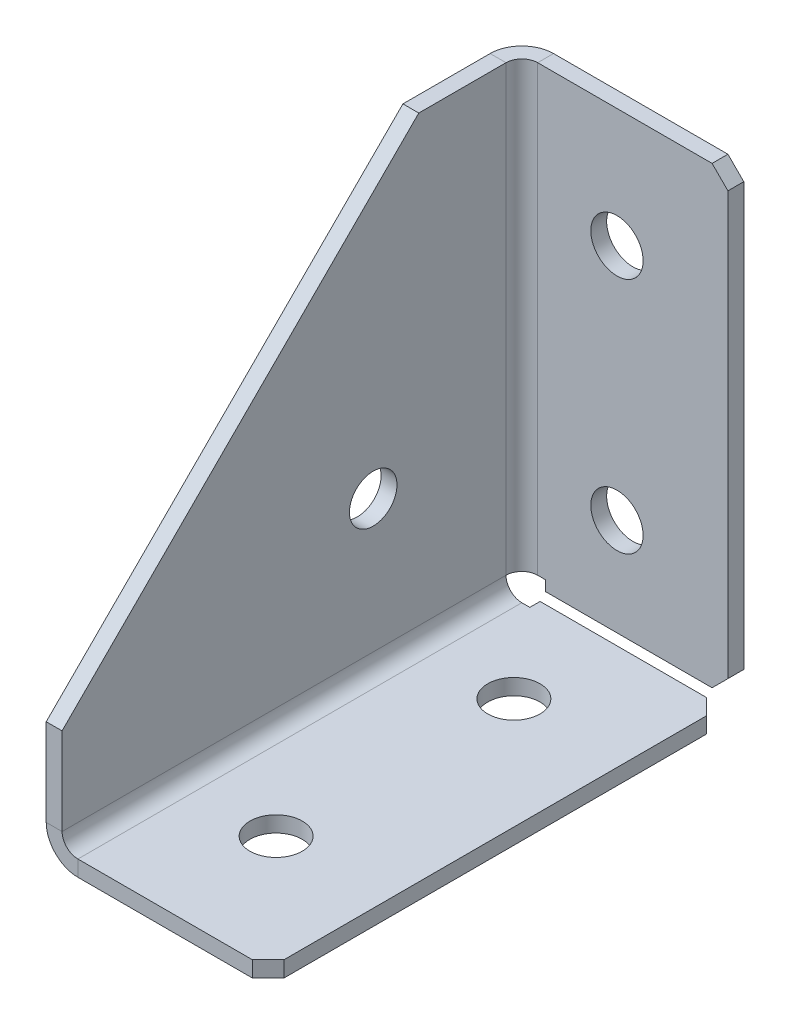
ISO-10303-21;
HEADER;
FILE_DESCRIPTION(('STEP AP214'),'2;1');
FILE_NAME('part.step','',(''),(''),'','','');
FILE_SCHEMA(('AUTOMOTIVE_DESIGN { 1 0 10303 214 1 1 1 1 }'));
ENDSEC;
DATA;
#1=APPLICATION_CONTEXT('core data for automotive mechanical design processes');
#2=APPLICATION_PROTOCOL_DEFINITION('international standard','automotive_design',2000,#1);
#3=PRODUCT_CONTEXT('',#1,'mechanical');
#4=PRODUCT('Part','Part','',(#3));
#5=PRODUCT_RELATED_PRODUCT_CATEGORY('part','',(#4));
#6=PRODUCT_DEFINITION_FORMATION('','',#4);
#7=PRODUCT_DEFINITION_CONTEXT('part definition',#1,'design');
#8=PRODUCT_DEFINITION('design','',#6,#7);
#9=PRODUCT_DEFINITION_SHAPE('','',#8);
#10=(LENGTH_UNIT() NAMED_UNIT(*) SI_UNIT(.MILLI.,.METRE.));
#11=(NAMED_UNIT(*) PLANE_ANGLE_UNIT() SI_UNIT($,.RADIAN.));
#12=(NAMED_UNIT(*) SI_UNIT($,.STERADIAN.) SOLID_ANGLE_UNIT());
#13=UNCERTAINTY_MEASURE_WITH_UNIT(LENGTH_MEASURE(1.E-05),#10,'distance_accuracy_value','');
#14=(GEOMETRIC_REPRESENTATION_CONTEXT(3) GLOBAL_UNCERTAINTY_ASSIGNED_CONTEXT((#13)) GLOBAL_UNIT_ASSIGNED_CONTEXT((#10,
#11,#12)) REPRESENTATION_CONTEXT('',''));
#15=CARTESIAN_POINT('',(0.,0.,0.));
#16=DIRECTION('',(0.,0.,1.));
#17=DIRECTION('',(1.,0.,0.));
#18=AXIS2_PLACEMENT_3D('',#15,#16,#17);
#19=CARTESIAN_POINT('',(4.,4.,3.99999999999997));
#20=DIRECTION('',(0.,0.,1.));
#21=DIRECTION('',(1.,0.,0.));
#22=AXIS2_PLACEMENT_3D('',#19,#20,#21);
#23=PLANE('',#22);
#24=DIRECTION('',(-1.,0.,0.));
#25=VECTOR('',#24,1.);
#26=CARTESIAN_POINT('',(0.,3.99999999999997,3.99999999999997));
#27=LINE('',#26,#25);
#28=CARTESIAN_POINT('',(2.,3.99999999999997,3.99999999999999));
#29=VERTEX_POINT('',#28);
#30=CARTESIAN_POINT('',(0.,3.99999999999997,3.99999999999997));
#31=VERTEX_POINT('',#30);
#32=EDGE_CURVE('E397',#29,#31,#27,.T.);
#33=ORIENTED_EDGE('',*,*,#32,.F.);
#34=CARTESIAN_POINT('',(4.,4.,3.99999999999997));
#35=DIRECTION('',(0.,0.,-1.));
#36=DIRECTION('',(-1.,0.,0.));
#37=AXIS2_PLACEMENT_3D('',#34,#35,#36);
#38=CIRCLE('',#37,2.);
#39=CARTESIAN_POINT('',(4.,2.,3.99999999999997));
#40=VERTEX_POINT('',#39);
#41=EDGE_CURVE('E342',#29,#40,#38,.F.);
#42=ORIENTED_EDGE('',*,*,#41,.T.);
#43=DIRECTION('',(0.,-1.,0.));
#44=VECTOR('',#43,1.);
#45=CARTESIAN_POINT('',(4.,0.,3.99999999999997));
#46=LINE('',#45,#44);
#47=CARTESIAN_POINT('',(4.,0.,3.99999999999997));
#48=VERTEX_POINT('',#47);
#49=EDGE_CURVE('E394',#40,#48,#46,.T.);
#50=ORIENTED_EDGE('',*,*,#49,.T.);
#51=CARTESIAN_POINT('',(4.,4.,3.99999999999997));
#52=DIRECTION('',(0.,0.,-1.));
#53=DIRECTION('',(-1.,0.,0.));
#54=AXIS2_PLACEMENT_3D('',#51,#52,#53);
#55=CIRCLE('',#54,4.);
#56=EDGE_CURVE('E281',#31,#48,#55,.F.);
#57=ORIENTED_EDGE('',*,*,#56,.F.);
#58=EDGE_LOOP('',(#33,#42,#50,#57));
#59=FACE_BOUND('',#58,.T.);
#60=ADVANCED_FACE('F44',(#59),#23,.F.);
#61=CARTESIAN_POINT('',(28.,0.,3.99999999999997));
#62=DIRECTION('',(0.,0.,1.));
#63=DIRECTION('',(1.,0.,0.));
#64=AXIS2_PLACEMENT_3D('',#61,#62,#63);
#65=PLANE('',#64);
#66=ORIENTED_EDGE('',*,*,#49,.F.);
#67=DIRECTION('',(1.,0.,0.));
#68=VECTOR('',#67,1.);
#69=CARTESIAN_POINT('',(28.,2.,3.99999999999997));
#70=LINE('',#69,#68);
#71=CARTESIAN_POINT('',(5.010401,2.,3.99999999999997));
#72=VERTEX_POINT('',#71);
#73=EDGE_CURVE('E312',#40,#72,#70,.T.);
#74=ORIENTED_EDGE('',*,*,#73,.T.);
#75=DIRECTION('',(0.,-1.,0.));
#76=VECTOR('',#75,1.);
#77=CARTESIAN_POINT('',(5.010401,0.,3.99999999999997));
#78=LINE('',#77,#76);
#79=CARTESIAN_POINT('',(5.010401,0.,3.99999999999997));
#80=VERTEX_POINT('',#79);
#81=EDGE_CURVE('E391',#72,#80,#78,.T.);
#82=ORIENTED_EDGE('',*,*,#81,.T.);
#83=DIRECTION('',(1.,0.,0.));
#84=VECTOR('',#83,1.);
#85=CARTESIAN_POINT('',(28.,0.,3.99999999999997));
#86=LINE('',#85,#84);
#87=EDGE_CURVE('E245',#48,#80,#86,.T.);
#88=ORIENTED_EDGE('',*,*,#87,.F.);
#89=EDGE_LOOP('',(#66,#74,#82,#88));
#90=FACE_BOUND('',#89,.T.);
#91=ADVANCED_FACE('F514',(#90),#65,.F.);
#92=CARTESIAN_POINT('',(5.010401,0.,60.));
#93=DIRECTION('',(-1.,0.,0.));
#94=DIRECTION('',(0.,0.,1.));
#95=AXIS2_PLACEMENT_3D('',#92,#93,#94);
#96=PLANE('',#95);
#97=ORIENTED_EDGE('',*,*,#81,.F.);
#98=DIRECTION('',(0.,0.,1.));
#99=VECTOR('',#98,1.);
#100=CARTESIAN_POINT('',(5.010401,2.,60.));
#101=LINE('',#100,#99);
#102=CARTESIAN_POINT('',(5.010401,2.,2.70710678118655));
#103=VERTEX_POINT('',#102);
#104=EDGE_CURVE('E352',#103,#72,#101,.T.);
#105=ORIENTED_EDGE('',*,*,#104,.F.);
#106=DIRECTION('',(0.,-1.,0.));
#107=VECTOR('',#106,1.);
#108=CARTESIAN_POINT('',(5.010401,0.,2.70710678118655));
#109=LINE('',#108,#107);
#110=CARTESIAN_POINT('',(5.010401,0.,2.70710678118655));
#111=VERTEX_POINT('',#110);
#112=EDGE_CURVE('E388',#103,#111,#109,.T.);
#113=ORIENTED_EDGE('',*,*,#112,.T.);
#114=DIRECTION('',(0.,0.,1.));
#115=VECTOR('',#114,1.);
#116=CARTESIAN_POINT('',(5.010401,0.,60.));
#117=LINE('',#116,#115);
#118=EDGE_CURVE('E241',#111,#80,#117,.T.);
#119=ORIENTED_EDGE('',*,*,#118,.T.);
#120=EDGE_LOOP('',(#97,#105,#113,#119));
#121=FACE_BOUND('',#120,.T.);
#122=ADVANCED_FACE('F519',(#121),#96,.T.);
#123=CARTESIAN_POINT('',(28.,0.,2.70710678118655));
#124=DIRECTION('',(0.,0.,1.));
#125=DIRECTION('',(1.,0.,0.));
#126=AXIS2_PLACEMENT_3D('',#123,#124,#125);
#127=PLANE('',#126);
#128=DIRECTION('',(1.,0.,0.));
#129=VECTOR('',#128,1.);
#130=CARTESIAN_POINT('',(28.,2.,2.70710678118655));
#131=LINE('',#130,#129);
#132=CARTESIAN_POINT('',(26.,2.,2.70710678118655));
#133=VERTEX_POINT('',#132);
#134=EDGE_CURVE('E316',#103,#133,#131,.T.);
#135=ORIENTED_EDGE('',*,*,#134,.T.);
#136=DIRECTION('',(0.,1.,0.));
#137=VECTOR('',#136,1.);
#138=CARTESIAN_POINT('',(26.,0.,2.70710678118655));
#139=LINE('',#138,#137);
#140=CARTESIAN_POINT('',(26.,0.,2.70710678118655));
#141=VERTEX_POINT('',#140);
#142=EDGE_CURVE('E424',#133,#141,#139,.F.);
#143=ORIENTED_EDGE('',*,*,#142,.T.);
#144=DIRECTION('',(1.,0.,0.));
#145=VECTOR('',#144,1.);
#146=CARTESIAN_POINT('',(28.,0.,2.70710678118655));
#147=LINE('',#146,#145);
#148=EDGE_CURVE('E237',#111,#141,#147,.T.);
#149=ORIENTED_EDGE('',*,*,#148,.F.);
#150=ORIENTED_EDGE('',*,*,#112,.F.);
#151=EDGE_LOOP('',(#135,#143,#149,#150));
#152=FACE_BOUND('',#151,.T.);
#153=ADVANCED_FACE('F556',(#152),#127,.F.);
#154=CARTESIAN_POINT('',(28.,0.,60.));
#155=DIRECTION('',(1.,0.,0.));
#156=DIRECTION('',(0.,0.,-1.));
#157=AXIS2_PLACEMENT_3D('',#154,#155,#156);
#158=PLANE('',#157);
#159=DIRECTION('',(0.,0.,1.));
#160=VECTOR('',#159,1.);
#161=CARTESIAN_POINT('',(28.,2.,60.));
#162=LINE('',#161,#160);
#163=CARTESIAN_POINT('',(28.,2.,58.));
#164=VERTEX_POINT('',#163);
#165=CARTESIAN_POINT('',(28.,2.,4.70710678118655));
#166=VERTEX_POINT('',#165);
#167=EDGE_CURVE('E345',#164,#166,#162,.F.);
#168=ORIENTED_EDGE('',*,*,#167,.F.);
#169=DIRECTION('',(0.,-1.,0.));
#170=VECTOR('',#169,1.);
#171=CARTESIAN_POINT('',(28.,0.,58.));
#172=LINE('',#171,#170);
#173=CARTESIAN_POINT('',(28.,0.,58.));
#174=VERTEX_POINT('',#173);
#175=EDGE_CURVE('E405',#164,#174,#172,.T.);
#176=ORIENTED_EDGE('',*,*,#175,.T.);
#177=DIRECTION('',(0.,0.,-1.));
#178=VECTOR('',#177,1.);
#179=CARTESIAN_POINT('',(28.,0.,60.));
#180=LINE('',#179,#178);
#181=CARTESIAN_POINT('',(28.,0.,4.70710678118655));
#182=VERTEX_POINT('',#181);
#183=EDGE_CURVE('E274',#174,#182,#180,.T.);
#184=ORIENTED_EDGE('',*,*,#183,.T.);
#185=DIRECTION('',(0.,1.,0.));
#186=VECTOR('',#185,1.);
#187=CARTESIAN_POINT('',(28.,0.,4.70710678118655));
#188=LINE('',#187,#186);
#189=EDGE_CURVE('E400',#182,#166,#188,.T.);
#190=ORIENTED_EDGE('',*,*,#189,.T.);
#191=EDGE_LOOP('',(#168,#176,#184,#190));
#192=FACE_BOUND('',#191,.T.);
#193=ADVANCED_FACE('F570',(#192),#158,.T.);
#194=CARTESIAN_POINT('',(28.,0.,60.));
#195=DIRECTION('',(0.,0.,-1.));
#196=DIRECTION('',(-1.,0.,0.));
#197=AXIS2_PLACEMENT_3D('',#194,#195,#196);
#198=PLANE('',#197);
#199=DIRECTION('',(-1.,0.,0.));
#200=VECTOR('',#199,1.);
#201=CARTESIAN_POINT('',(28.,0.,60.));
#202=LINE('',#201,#200);
#203=CARTESIAN_POINT('',(26.,0.,60.));
#204=VERTEX_POINT('',#203);
#205=CARTESIAN_POINT('',(4.,0.,60.));
#206=VERTEX_POINT('',#205);
#207=EDGE_CURVE('E216',#204,#206,#202,.T.);
#208=ORIENTED_EDGE('',*,*,#207,.F.);
#209=DIRECTION('',(0.,-1.,0.));
#210=VECTOR('',#209,1.);
#211=CARTESIAN_POINT('',(26.,0.,60.));
#212=LINE('',#211,#210);
#213=CARTESIAN_POINT('',(26.,2.,60.));
#214=VERTEX_POINT('',#213);
#215=EDGE_CURVE('E415',#204,#214,#212,.F.);
#216=ORIENTED_EDGE('',*,*,#215,.T.);
#217=DIRECTION('',(1.,0.,0.));
#218=VECTOR('',#217,1.);
#219=CARTESIAN_POINT('',(28.,2.,60.));
#220=LINE('',#219,#218);
#221=CARTESIAN_POINT('',(4.,2.,60.));
#222=VERTEX_POINT('',#221);
#223=EDGE_CURVE('E338',#214,#222,#220,.F.);
#224=ORIENTED_EDGE('',*,*,#223,.T.);
#225=DIRECTION('',(0.,-1.,0.));
#226=VECTOR('',#225,1.);
#227=CARTESIAN_POINT('',(4.,0.,60.));
#228=LINE('',#227,#226);
#229=EDGE_CURVE('E384',#222,#206,#228,.T.);
#230=ORIENTED_EDGE('',*,*,#229,.T.);
#231=EDGE_LOOP('',(#208,#216,#224,#230));
#232=FACE_BOUND('',#231,.T.);
#233=ADVANCED_FACE('F664',(#232),#198,.F.);
#234=CARTESIAN_POINT('',(4.,4.,60.));
#235=DIRECTION('',(0.,0.,1.));
#236=DIRECTION('',(1.,0.,0.));
#237=AXIS2_PLACEMENT_3D('',#234,#235,#236);
#238=PLANE('',#237);
#239=ORIENTED_EDGE('',*,*,#229,.F.);
#240=CARTESIAN_POINT('',(4.,4.,60.));
#241=DIRECTION('',(0.,0.,-1.));
#242=DIRECTION('',(-1.,0.,0.));
#243=AXIS2_PLACEMENT_3D('',#240,#241,#242);
#244=CIRCLE('',#243,2.);
#245=CARTESIAN_POINT('',(2.,4.,60.));
#246=VERTEX_POINT('',#245);
#247=EDGE_CURVE('E329',#222,#246,#244,.T.);
#248=ORIENTED_EDGE('',*,*,#247,.T.);
#249=DIRECTION('',(-1.,0.,0.));
#250=VECTOR('',#249,1.);
#251=CARTESIAN_POINT('',(0.,4.,60.));
#252=LINE('',#251,#250);
#253=CARTESIAN_POINT('',(0.,4.,60.));
#254=VERTEX_POINT('',#253);
#255=EDGE_CURVE('E203',#246,#254,#252,.T.);
#256=ORIENTED_EDGE('',*,*,#255,.T.);
#257=CARTESIAN_POINT('',(4.,4.,60.));
#258=DIRECTION('',(0.,0.,-1.));
#259=DIRECTION('',(-1.,0.,0.));
#260=AXIS2_PLACEMENT_3D('',#257,#258,#259);
#261=CIRCLE('',#260,4.);
#262=EDGE_CURVE('E270',#206,#254,#261,.T.);
#263=ORIENTED_EDGE('',*,*,#262,.F.);
#264=EDGE_LOOP('',(#239,#248,#256,#263));
#265=FACE_BOUND('',#264,.T.);
#266=ADVANCED_FACE('F487',(#265),#238,.T.);
#267=CARTESIAN_POINT('',(0.,15.,60.));
#268=DIRECTION('',(0.,0.,1.));
#269=DIRECTION('',(0.,-1.,0.));
#270=AXIS2_PLACEMENT_3D('',#267,#268,#269);
#271=PLANE('',#270);
#272=ORIENTED_EDGE('',*,*,#255,.F.);
#273=DIRECTION('',(0.,1.,0.));
#274=VECTOR('',#273,1.);
#275=CARTESIAN_POINT('',(2.,0.,60.));
#276=LINE('',#275,#274);
#277=CARTESIAN_POINT('',(2.,15.,60.));
#278=VERTEX_POINT('',#277);
#279=EDGE_CURVE('E197',#278,#246,#276,.F.);
#280=ORIENTED_EDGE('',*,*,#279,.F.);
#281=DIRECTION('',(-1.,0.,0.));
#282=VECTOR('',#281,1.);
#283=CARTESIAN_POINT('',(0.,15.,60.));
#284=LINE('',#283,#282);
#285=CARTESIAN_POINT('',(0.,15.,60.));
#286=VERTEX_POINT('',#285);
#287=EDGE_CURVE('E191',#278,#286,#284,.T.);
#288=ORIENTED_EDGE('',*,*,#287,.T.);
#289=DIRECTION('',(0.,-1.,0.));
#290=VECTOR('',#289,1.);
#291=CARTESIAN_POINT('',(0.,15.,60.));
#292=LINE('',#291,#290);
#293=EDGE_CURVE('E194',#286,#254,#292,.T.);
#294=ORIENTED_EDGE('',*,*,#293,.T.);
#295=EDGE_LOOP('',(#272,#280,#288,#294));
#296=FACE_BOUND('',#295,.T.);
#297=ADVANCED_FACE('F193',(#296),#271,.T.);
#298=CARTESIAN_POINT('',(0.,60.,15.));
#299=DIRECTION('',(0.,0.707106781186548,0.707106781186548));
#300=DIRECTION('',(0.,-0.707106781186548,0.707106781186548));
#301=AXIS2_PLACEMENT_3D('',#298,#299,#300);
#302=PLANE('',#301);
#303=ORIENTED_EDGE('',*,*,#287,.F.);
#304=DIRECTION('',(0.,-0.707106781186548,0.707106781186548));
#305=VECTOR('',#304,1.);
#306=CARTESIAN_POINT('',(2.,60.,15.));
#307=LINE('',#306,#305);
#308=CARTESIAN_POINT('',(2.,60.,15.));
#309=VERTEX_POINT('',#308);
#310=EDGE_CURVE('E333',#309,#278,#307,.T.);
#311=ORIENTED_EDGE('',*,*,#310,.F.);
#312=DIRECTION('',(-1.,0.,0.));
#313=VECTOR('',#312,1.);
#314=CARTESIAN_POINT('',(0.,60.,15.));
#315=LINE('',#314,#313);
#316=CARTESIAN_POINT('',(0.,60.,15.));
#317=VERTEX_POINT('',#316);
#318=EDGE_CURVE('E204',#309,#317,#315,.T.);
#319=ORIENTED_EDGE('',*,*,#318,.T.);
#320=DIRECTION('',(0.,-0.707106781186548,0.707106781186548));
#321=VECTOR('',#320,1.);
#322=CARTESIAN_POINT('',(0.,60.,15.));
#323=LINE('',#322,#321);
#324=EDGE_CURVE('E211',#317,#286,#323,.T.);
#325=ORIENTED_EDGE('',*,*,#324,.T.);
#326=EDGE_LOOP('',(#303,#311,#319,#325));
#327=FACE_BOUND('',#326,.T.);
#328=ADVANCED_FACE('F218',(#327),#302,.T.);
#329=CARTESIAN_POINT('',(0.,60.,0.));
#330=DIRECTION('',(0.,1.,0.));
#331=DIRECTION('',(0.,0.,1.));
#332=AXIS2_PLACEMENT_3D('',#329,#330,#331);
#333=PLANE('',#332);
#334=ORIENTED_EDGE('',*,*,#318,.F.);
#335=DIRECTION('',(0.,0.,-1.));
#336=VECTOR('',#335,1.);
#337=CARTESIAN_POINT('',(2.,60.,0.));
#338=LINE('',#337,#336);
#339=CARTESIAN_POINT('',(2.,60.,4.));
#340=VERTEX_POINT('',#339);
#341=EDGE_CURVE('E323',#340,#309,#338,.F.);
#342=ORIENTED_EDGE('',*,*,#341,.F.);
#343=DIRECTION('',(-1.,0.,0.));
#344=VECTOR('',#343,1.);
#345=CARTESIAN_POINT('',(0.,60.,4.));
#346=LINE('',#345,#344);
#347=CARTESIAN_POINT('',(0.,60.,4.));
#348=VERTEX_POINT('',#347);
#349=EDGE_CURVE('E377',#340,#348,#346,.T.);
#350=ORIENTED_EDGE('',*,*,#349,.T.);
#351=DIRECTION('',(0.,0.,1.));
#352=VECTOR('',#351,1.);
#353=CARTESIAN_POINT('',(0.,60.,0.));
#354=LINE('',#353,#352);
#355=EDGE_CURVE('E220',#348,#317,#354,.T.);
#356=ORIENTED_EDGE('',*,*,#355,.T.);
#357=EDGE_LOOP('',(#334,#342,#350,#356));
#358=FACE_BOUND('',#357,.T.);
#359=ADVANCED_FACE('F499',(#358),#333,.T.);
#360=CARTESIAN_POINT('',(4.,60.,4.));
#361=DIRECTION('',(0.,-1.,0.));
#362=DIRECTION('',(0.,0.,-1.));
#363=AXIS2_PLACEMENT_3D('',#360,#361,#362);
#364=PLANE('',#363);
#365=ORIENTED_EDGE('',*,*,#349,.F.);
#366=CARTESIAN_POINT('',(4.,60.,4.));
#367=DIRECTION('',(0.,1.,0.));
#368=DIRECTION('',(0.,0.,1.));
#369=AXIS2_PLACEMENT_3D('',#366,#367,#368);
#370=CIRCLE('',#369,2.);
#371=CARTESIAN_POINT('',(4.,60.,2.));
#372=VERTEX_POINT('',#371);
#373=EDGE_CURVE('E324',#340,#372,#370,.F.);
#374=ORIENTED_EDGE('',*,*,#373,.T.);
#375=DIRECTION('',(0.,0.,-1.));
#376=VECTOR('',#375,1.);
#377=CARTESIAN_POINT('',(4.,60.,0.));
#378=LINE('',#377,#376);
#379=CARTESIAN_POINT('',(4.,60.,0.));
#380=VERTEX_POINT('',#379);
#381=EDGE_CURVE('E373',#372,#380,#378,.T.);
#382=ORIENTED_EDGE('',*,*,#381,.T.);
#383=CARTESIAN_POINT('',(4.,60.,4.));
#384=DIRECTION('',(0.,1.,0.));
#385=DIRECTION('',(0.,0.,1.));
#386=AXIS2_PLACEMENT_3D('',#383,#384,#385);
#387=CIRCLE('',#386,4.);
#388=EDGE_CURVE('E265',#348,#380,#387,.F.);
#389=ORIENTED_EDGE('',*,*,#388,.F.);
#390=EDGE_LOOP('',(#365,#374,#382,#389));
#391=FACE_BOUND('',#390,.T.);
#392=ADVANCED_FACE('F501',(#391),#364,.F.);
#393=CARTESIAN_POINT('',(28.,60.,0.));
#394=DIRECTION('',(0.,1.,0.));
#395=DIRECTION('',(-1.,0.,0.));
#396=AXIS2_PLACEMENT_3D('',#393,#394,#395);
#397=PLANE('',#396);
#398=DIRECTION('',(1.,0.,0.));
#399=VECTOR('',#398,1.);
#400=CARTESIAN_POINT('',(28.,60.,2.));
#401=LINE('',#400,#399);
#402=CARTESIAN_POINT('',(26.,60.,2.));
#403=VERTEX_POINT('',#402);
#404=EDGE_CURVE('E320',#403,#372,#401,.F.);
#405=ORIENTED_EDGE('',*,*,#404,.F.);
#406=DIRECTION('',(0.,0.,-1.));
#407=VECTOR('',#406,1.);
#408=CARTESIAN_POINT('',(26.,60.,0.));
#409=LINE('',#408,#407);
#410=CARTESIAN_POINT('',(26.,60.,0.));
#411=VERTEX_POINT('',#410);
#412=EDGE_CURVE('E11',#403,#411,#409,.T.);
#413=ORIENTED_EDGE('',*,*,#412,.T.);
#414=DIRECTION('',(-1.,0.,0.));
#415=VECTOR('',#414,1.);
#416=CARTESIAN_POINT('',(28.,60.,0.));
#417=LINE('',#416,#415);
#418=EDGE_CURVE('E224',#411,#380,#417,.T.);
#419=ORIENTED_EDGE('',*,*,#418,.T.);
#420=ORIENTED_EDGE('',*,*,#381,.F.);
#421=EDGE_LOOP('',(#405,#413,#419,#420));
#422=FACE_BOUND('',#421,.T.);
#423=ADVANCED_FACE('F505',(#422),#397,.T.);
#424=CARTESIAN_POINT('',(28.,0.,0.));
#425=DIRECTION('',(1.,0.,0.));
#426=DIRECTION('',(0.,1.,0.));
#427=AXIS2_PLACEMENT_3D('',#424,#425,#426);
#428=PLANE('',#427);
#429=DIRECTION('',(0.,1.,0.));
#430=VECTOR('',#429,1.);
#431=CARTESIAN_POINT('',(28.,0.,2.));
#432=LINE('',#431,#430);
#433=CARTESIAN_POINT('',(28.,4.70710678118655,2.));
#434=VERTEX_POINT('',#433);
#435=CARTESIAN_POINT('',(28.,58.,2.));
#436=VERTEX_POINT('',#435);
#437=EDGE_CURVE('E317',#434,#436,#432,.T.);
#438=ORIENTED_EDGE('',*,*,#437,.F.);
#439=DIRECTION('',(0.,0.,-1.));
#440=VECTOR('',#439,1.);
#441=CARTESIAN_POINT('',(28.,4.70710678118655,0.));
#442=LINE('',#441,#440);
#443=CARTESIAN_POINT('',(28.,4.70710678118655,0.));
#444=VERTEX_POINT('',#443);
#445=EDGE_CURVE('E431',#434,#444,#442,.T.);
#446=ORIENTED_EDGE('',*,*,#445,.T.);
#447=DIRECTION('',(0.,1.,0.));
#448=VECTOR('',#447,1.);
#449=CARTESIAN_POINT('',(28.,0.,0.));
#450=LINE('',#449,#448);
#451=CARTESIAN_POINT('',(28.,58.,0.));
#452=VERTEX_POINT('',#451);
#453=EDGE_CURVE('E230',#444,#452,#450,.T.);
#454=ORIENTED_EDGE('',*,*,#453,.T.);
#455=DIRECTION('',(0.,0.,1.));
#456=VECTOR('',#455,1.);
#457=CARTESIAN_POINT('',(28.,58.,0.));
#458=LINE('',#457,#456);
#459=EDGE_CURVE('E428',#452,#436,#458,.T.);
#460=ORIENTED_EDGE('',*,*,#459,.T.);
#461=EDGE_LOOP('',(#438,#446,#454,#460));
#462=FACE_BOUND('',#461,.T.);
#463=ADVANCED_FACE('F452',(#462),#428,.T.);
#464=CARTESIAN_POINT('',(28.,2.70710678118655,0.));
#465=DIRECTION('',(0.,1.,0.));
#466=DIRECTION('',(-1.,0.,0.));
#467=AXIS2_PLACEMENT_3D('',#464,#465,#466);
#468=PLANE('',#467);
#469=DIRECTION('',(-1.,0.,0.));
#470=VECTOR('',#469,1.);
#471=CARTESIAN_POINT('',(28.,2.70710678118655,0.));
#472=LINE('',#471,#470);
#473=CARTESIAN_POINT('',(26.,2.70710678118655,0.));
#474=VERTEX_POINT('',#473);
#475=CARTESIAN_POINT('',(5.010401,2.70710678118655,0.));
#476=VERTEX_POINT('',#475);
#477=EDGE_CURVE('E234',#474,#476,#472,.T.);
#478=ORIENTED_EDGE('',*,*,#477,.F.);
#479=DIRECTION('',(0.,0.,-1.));
#480=VECTOR('',#479,1.);
#481=CARTESIAN_POINT('',(26.,2.70710678118655,0.));
#482=LINE('',#481,#480);
#483=CARTESIAN_POINT('',(26.,2.70710678118655,2.));
#484=VERTEX_POINT('',#483);
#485=EDGE_CURVE('E69',#474,#484,#482,.F.);
#486=ORIENTED_EDGE('',*,*,#485,.T.);
#487=DIRECTION('',(1.,0.,0.));
#488=VECTOR('',#487,1.);
#489=CARTESIAN_POINT('',(28.,2.70710678118655,2.));
#490=LINE('',#489,#488);
#491=CARTESIAN_POINT('',(5.010401,2.70710678118655,2.));
#492=VERTEX_POINT('',#491);
#493=EDGE_CURVE('E313',#484,#492,#490,.F.);
#494=ORIENTED_EDGE('',*,*,#493,.T.);
#495=DIRECTION('',(0.,0.,-1.));
#496=VECTOR('',#495,1.);
#497=CARTESIAN_POINT('',(5.010401,2.70710678118655,0.));
#498=LINE('',#497,#496);
#499=EDGE_CURVE('E369',#492,#476,#498,.T.);
#500=ORIENTED_EDGE('',*,*,#499,.T.);
#501=EDGE_LOOP('',(#478,#486,#494,#500));
#502=FACE_BOUND('',#501,.T.);
#503=ADVANCED_FACE('F459',(#502),#468,.F.);
#504=CARTESIAN_POINT('',(5.010401,0.,0.));
#505=DIRECTION('',(-1.,0.,0.));
#506=DIRECTION('',(0.,-1.,0.));
#507=AXIS2_PLACEMENT_3D('',#504,#505,#506);
#508=PLANE('',#507);
#509=ORIENTED_EDGE('',*,*,#499,.F.);
#510=DIRECTION('',(0.,1.,0.));
#511=VECTOR('',#510,1.);
#512=CARTESIAN_POINT('',(5.010401,0.,2.));
#513=LINE('',#512,#511);
#514=CARTESIAN_POINT('',(5.010401,3.99999999999997,2.));
#515=VERTEX_POINT('',#514);
#516=EDGE_CURVE('E308',#515,#492,#513,.F.);
#517=ORIENTED_EDGE('',*,*,#516,.F.);
#518=DIRECTION('',(0.,0.,-1.));
#519=VECTOR('',#518,1.);
#520=CARTESIAN_POINT('',(5.010401,3.99999999999997,0.));
#521=LINE('',#520,#519);
#522=CARTESIAN_POINT('',(5.010401,3.99999999999997,0.));
#523=VERTEX_POINT('',#522);
#524=EDGE_CURVE('E366',#515,#523,#521,.T.);
#525=ORIENTED_EDGE('',*,*,#524,.T.);
#526=DIRECTION('',(0.,-1.,0.));
#527=VECTOR('',#526,1.);
#528=CARTESIAN_POINT('',(5.010401,0.,0.));
#529=LINE('',#528,#527);
#530=EDGE_CURVE('E249',#523,#476,#529,.T.);
#531=ORIENTED_EDGE('',*,*,#530,.T.);
#532=EDGE_LOOP('',(#509,#517,#525,#531));
#533=FACE_BOUND('',#532,.T.);
#534=ADVANCED_FACE('F463',(#533),#508,.T.);
#535=CARTESIAN_POINT('',(28.,3.99999999999997,0.));
#536=DIRECTION('',(0.,1.,0.));
#537=DIRECTION('',(-1.,0.,0.));
#538=AXIS2_PLACEMENT_3D('',#535,#536,#537);
#539=PLANE('',#538);
#540=ORIENTED_EDGE('',*,*,#524,.F.);
#541=DIRECTION('',(1.,0.,0.));
#542=VECTOR('',#541,1.);
#543=CARTESIAN_POINT('',(28.,3.99999999999997,2.));
#544=LINE('',#543,#542);
#545=CARTESIAN_POINT('',(4.,3.99999999999997,2.));
#546=VERTEX_POINT('',#545);
#547=EDGE_CURVE('E294',#515,#546,#544,.F.);
#548=ORIENTED_EDGE('',*,*,#547,.T.);
#549=DIRECTION('',(0.,0.,-1.));
#550=VECTOR('',#549,1.);
#551=CARTESIAN_POINT('',(4.,3.99999999999997,0.));
#552=LINE('',#551,#550);
#553=CARTESIAN_POINT('',(4.,3.99999999999997,0.));
#554=VERTEX_POINT('',#553);
#555=EDGE_CURVE('E280',#546,#554,#552,.T.);
#556=ORIENTED_EDGE('',*,*,#555,.T.);
#557=DIRECTION('',(-1.,0.,0.));
#558=VECTOR('',#557,1.);
#559=CARTESIAN_POINT('',(28.,3.99999999999997,0.));
#560=LINE('',#559,#558);
#561=EDGE_CURVE('E253',#523,#554,#560,.T.);
#562=ORIENTED_EDGE('',*,*,#561,.F.);
#563=EDGE_LOOP('',(#540,#548,#556,#562));
#564=FACE_BOUND('',#563,.T.);
#565=ADVANCED_FACE('F467',(#564),#539,.F.);
#566=CARTESIAN_POINT('',(4.,3.99999999999997,4.));
#567=DIRECTION('',(0.,1.,0.));
#568=DIRECTION('',(0.,0.,1.));
#569=AXIS2_PLACEMENT_3D('',#566,#567,#568);
#570=PLANE('',#569);
#571=CARTESIAN_POINT('',(4.,3.99999999999997,4.));
#572=DIRECTION('',(0.,1.,0.));
#573=DIRECTION('',(0.,0.,1.));
#574=AXIS2_PLACEMENT_3D('',#571,#572,#573);
#575=CIRCLE('',#574,2.);
#576=EDGE_CURVE('E328',#546,#29,#575,.T.);
#577=ORIENTED_EDGE('',*,*,#576,.T.);
#578=ORIENTED_EDGE('',*,*,#32,.T.);
#579=CARTESIAN_POINT('',(4.,3.99999999999997,4.));
#580=DIRECTION('',(0.,-1.,0.));
#581=DIRECTION('',(0.,0.,-1.));
#582=AXIS2_PLACEMENT_3D('',#579,#580,#581);
#583=CIRCLE('',#582,4.);
#584=EDGE_CURVE('E269',#554,#31,#583,.F.);
#585=ORIENTED_EDGE('',*,*,#584,.F.);
#586=ORIENTED_EDGE('',*,*,#555,.F.);
#587=EDGE_LOOP('',(#577,#578,#585,#586));
#588=FACE_BOUND('',#587,.T.);
#589=ADVANCED_FACE('F472',(#588),#570,.F.);
#590=CARTESIAN_POINT('',(28.,0.,0.));
#591=DIRECTION('',(0.,0.,1.));
#592=DIRECTION('',(1.,0.,0.));
#593=AXIS2_PLACEMENT_3D('',#590,#591,#592);
#594=PLANE('',#593);
#595=CARTESIAN_POINT('',(14.,45.,0.));
#596=DIRECTION('',(0.,0.,1.));
#597=DIRECTION('',(1.,0.,0.));
#598=AXIS2_PLACEMENT_3D('',#595,#596,#597);
#599=CIRCLE('',#598,3.3);
#600=CARTESIAN_POINT('',(17.3,45.,0.));
#601=VERTEX_POINT('',#600);
#602=EDGE_CURVE('E584',#601,#601,#599,.T.);
#603=ORIENTED_EDGE('',*,*,#602,.T.);
#604=EDGE_LOOP('',(#603));
#605=FACE_BOUND('',#604,.T.);
#606=CARTESIAN_POINT('',(14.,15.,0.));
#607=DIRECTION('',(0.,0.,1.));
#608=DIRECTION('',(1.,0.,0.));
#609=AXIS2_PLACEMENT_3D('',#606,#607,#608);
#610=CIRCLE('',#609,3.3);
#611=CARTESIAN_POINT('',(17.3,15.,0.));
#612=VERTEX_POINT('',#611);
#613=EDGE_CURVE('E362',#612,#612,#610,.T.);
#614=ORIENTED_EDGE('',*,*,#613,.T.);
#615=EDGE_LOOP('',(#614));
#616=FACE_BOUND('',#615,.T.);
#617=ORIENTED_EDGE('',*,*,#453,.F.);
#618=DIRECTION('',(-0.707106781186548,-0.707106781186548,0.));
#619=VECTOR('',#618,1.);
#620=CARTESIAN_POINT('',(28.,4.70710678118655,0.));
#621=LINE('',#620,#619);
#622=EDGE_CURVE('E438',#444,#474,#621,.T.);
#623=ORIENTED_EDGE('',*,*,#622,.T.);
#624=ORIENTED_EDGE('',*,*,#477,.T.);
#625=ORIENTED_EDGE('',*,*,#530,.F.);
#626=ORIENTED_EDGE('',*,*,#561,.T.);
#627=DIRECTION('',(0.,1.,0.));
#628=VECTOR('',#627,1.);
#629=CARTESIAN_POINT('',(4.,0.,0.));
#630=LINE('',#629,#628);
#631=EDGE_CURVE('E257',#554,#380,#630,.T.);
#632=ORIENTED_EDGE('',*,*,#631,.T.);
#633=ORIENTED_EDGE('',*,*,#418,.F.);
#634=DIRECTION('',(-0.707106781186548,0.707106781186548,0.));
#635=VECTOR('',#634,1.);
#636=CARTESIAN_POINT('',(26.,60.,0.));
#637=LINE('',#636,#635);
#638=EDGE_CURVE('E435',#411,#452,#637,.F.);
#639=ORIENTED_EDGE('',*,*,#638,.T.);
#640=EDGE_LOOP('',(#617,#623,#624,#625,#626,#632,#633,#639));
#641=FACE_BOUND('',#640,.T.);
#642=ADVANCED_FACE('F457',(#605,#616,#641),#594,.F.);
#643=CARTESIAN_POINT('',(0.,0.,0.));
#644=DIRECTION('',(1.,0.,0.));
#645=DIRECTION('',(0.,0.,-1.));
#646=AXIS2_PLACEMENT_3D('',#643,#644,#645);
#647=PLANE('',#646);
#648=CARTESIAN_POINT('',(0.,20.75,20.75));
#649=DIRECTION('',(1.,0.,0.));
#650=DIRECTION('',(0.,0.,-1.));
#651=AXIS2_PLACEMENT_3D('',#648,#649,#650);
#652=CIRCLE('',#651,3.);
#653=CARTESIAN_POINT('',(0.,20.75,17.75));
#654=VERTEX_POINT('',#653);
#655=EDGE_CURVE('E608',#654,#654,#652,.T.);
#656=ORIENTED_EDGE('',*,*,#655,.T.);
#657=EDGE_LOOP('',(#656));
#658=FACE_BOUND('',#657,.T.);
#659=DIRECTION('',(0.,1.,0.));
#660=VECTOR('',#659,1.);
#661=CARTESIAN_POINT('',(0.,0.,4.));
#662=LINE('',#661,#660);
#663=EDGE_CURVE('E261',#348,#31,#662,.F.);
#664=ORIENTED_EDGE('',*,*,#663,.T.);
#665=DIRECTION('',(0.,0.,-1.));
#666=VECTOR('',#665,1.);
#667=CARTESIAN_POINT('',(0.,4.,0.));
#668=LINE('',#667,#666);
#669=EDGE_CURVE('E214',#31,#254,#668,.F.);
#670=ORIENTED_EDGE('',*,*,#669,.T.);
#671=ORIENTED_EDGE('',*,*,#293,.F.);
#672=ORIENTED_EDGE('',*,*,#324,.F.);
#673=ORIENTED_EDGE('',*,*,#355,.F.);
#674=EDGE_LOOP('',(#664,#670,#671,#672,#673));
#675=FACE_BOUND('',#674,.T.);
#676=ADVANCED_FACE('F209',(#658,#675),#647,.F.);
#677=CARTESIAN_POINT('',(28.,0.,60.));
#678=DIRECTION('',(0.,1.,0.));
#679=DIRECTION('',(0.,0.,1.));
#680=AXIS2_PLACEMENT_3D('',#677,#678,#679);
#681=PLANE('',#680);
#682=CARTESIAN_POINT('',(14.,0.,45.));
#683=DIRECTION('',(0.,1.,0.));
#684=DIRECTION('',(0.,0.,1.));
#685=AXIS2_PLACEMENT_3D('',#682,#683,#684);
#686=CIRCLE('',#685,3.3);
#687=CARTESIAN_POINT('',(14.,0.,48.3));
#688=VERTEX_POINT('',#687);
#689=EDGE_CURVE('E600',#688,#688,#686,.T.);
#690=ORIENTED_EDGE('',*,*,#689,.T.);
#691=EDGE_LOOP('',(#690));
#692=FACE_BOUND('',#691,.T.);
#693=CARTESIAN_POINT('',(14.,0.,15.));
#694=DIRECTION('',(0.,1.,0.));
#695=DIRECTION('',(0.,0.,1.));
#696=AXIS2_PLACEMENT_3D('',#693,#694,#695);
#697=CIRCLE('',#696,3.3);
#698=CARTESIAN_POINT('',(14.,0.,18.3));
#699=VERTEX_POINT('',#698);
#700=EDGE_CURVE('E592',#699,#699,#697,.T.);
#701=ORIENTED_EDGE('',*,*,#700,.T.);
#702=EDGE_LOOP('',(#701));
#703=FACE_BOUND('',#702,.T.);
#704=ORIENTED_EDGE('',*,*,#183,.F.);
#705=DIRECTION('',(-0.707106781186548,0.,0.707106781186548));
#706=VECTOR('',#705,1.);
#707=CARTESIAN_POINT('',(28.,0.,58.));
#708=LINE('',#707,#706);
#709=EDGE_CURVE('E412',#174,#204,#708,.T.);
#710=ORIENTED_EDGE('',*,*,#709,.T.);
#711=ORIENTED_EDGE('',*,*,#207,.T.);
#712=DIRECTION('',(0.,0.,-1.));
#713=VECTOR('',#712,1.);
#714=CARTESIAN_POINT('',(4.,0.,60.));
#715=LINE('',#714,#713);
#716=EDGE_CURVE('E264',#206,#48,#715,.T.);
#717=ORIENTED_EDGE('',*,*,#716,.T.);
#718=ORIENTED_EDGE('',*,*,#87,.T.);
#719=ORIENTED_EDGE('',*,*,#118,.F.);
#720=ORIENTED_EDGE('',*,*,#148,.T.);
#721=DIRECTION('',(0.707106781186548,0.,0.707106781186548));
#722=VECTOR('',#721,1.);
#723=CARTESIAN_POINT('',(26.,0.,2.70710678118655));
#724=LINE('',#723,#722);
#725=EDGE_CURVE('E409',#141,#182,#724,.T.);
#726=ORIENTED_EDGE('',*,*,#725,.T.);
#727=EDGE_LOOP('',(#704,#710,#711,#717,#718,#719,#720,#726));
#728=FACE_BOUND('',#727,.T.);
#729=ADVANCED_FACE('F562',(#692,#703,#728),#681,.F.);
#730=CARTESIAN_POINT('',(4.,0.,4.));
#731=DIRECTION('',(0.,1.,0.));
#732=DIRECTION('',(0.,0.,1.));
#733=AXIS2_PLACEMENT_3D('',#730,#731,#732);
#734=CYLINDRICAL_SURFACE('',#733,4.);
#735=ORIENTED_EDGE('',*,*,#584,.T.);
#736=ORIENTED_EDGE('',*,*,#663,.F.);
#737=ORIENTED_EDGE('',*,*,#388,.T.);
#738=ORIENTED_EDGE('',*,*,#631,.F.);
#739=EDGE_LOOP('',(#735,#736,#737,#738));
#740=FACE_BOUND('',#739,.T.);
#741=ADVANCED_FACE('F476',(#740),#734,.T.);
#742=CARTESIAN_POINT('',(4.,4.,60.));
#743=DIRECTION('',(0.,0.,-1.));
#744=DIRECTION('',(-1.,0.,0.));
#745=AXIS2_PLACEMENT_3D('',#742,#743,#744);
#746=CYLINDRICAL_SURFACE('',#745,4.);
#747=ORIENTED_EDGE('',*,*,#262,.T.);
#748=ORIENTED_EDGE('',*,*,#669,.F.);
#749=ORIENTED_EDGE('',*,*,#56,.T.);
#750=ORIENTED_EDGE('',*,*,#716,.F.);
#751=EDGE_LOOP('',(#747,#748,#749,#750));
#752=FACE_BOUND('',#751,.T.);
#753=ADVANCED_FACE('F483',(#752),#746,.T.);
#754=CARTESIAN_POINT('',(28.,0.,2.));
#755=DIRECTION('',(0.,0.,1.));
#756=DIRECTION('',(1.,0.,0.));
#757=AXIS2_PLACEMENT_3D('',#754,#755,#756);
#758=PLANE('',#757);
#759=CARTESIAN_POINT('',(14.,45.,2.));
#760=DIRECTION('',(0.,0.,1.));
#761=DIRECTION('',(1.,0.,0.));
#762=AXIS2_PLACEMENT_3D('',#759,#760,#761);
#763=CIRCLE('',#762,3.3);
#764=CARTESIAN_POINT('',(17.3,45.,2.));
#765=VERTEX_POINT('',#764);
#766=EDGE_CURVE('E588',#765,#765,#763,.T.);
#767=ORIENTED_EDGE('',*,*,#766,.F.);
#768=EDGE_LOOP('',(#767));
#769=FACE_BOUND('',#768,.T.);
#770=CARTESIAN_POINT('',(14.,15.,2.));
#771=DIRECTION('',(0.,0.,1.));
#772=DIRECTION('',(1.,0.,0.));
#773=AXIS2_PLACEMENT_3D('',#770,#771,#772);
#774=CIRCLE('',#773,3.3);
#775=CARTESIAN_POINT('',(17.3,15.,2.));
#776=VERTEX_POINT('',#775);
#777=EDGE_CURVE('E580',#776,#776,#774,.T.);
#778=ORIENTED_EDGE('',*,*,#777,.F.);
#779=EDGE_LOOP('',(#778));
#780=FACE_BOUND('',#779,.T.);
#781=ORIENTED_EDGE('',*,*,#493,.F.);
#782=DIRECTION('',(0.707106781186548,0.707106781186548,0.));
#783=VECTOR('',#782,1.);
#784=CARTESIAN_POINT('',(25.6464466094067,2.35355339059327,2.));
#785=LINE('',#784,#783);
#786=EDGE_CURVE('E54',#484,#434,#785,.T.);
#787=ORIENTED_EDGE('',*,*,#786,.T.);
#788=ORIENTED_EDGE('',*,*,#437,.T.);
#789=DIRECTION('',(0.707106781186548,-0.707106781186548,0.));
#790=VECTOR('',#789,1.);
#791=CARTESIAN_POINT('',(57.,29.,2.));
#792=LINE('',#791,#790);
#793=EDGE_CURVE('E61',#436,#403,#792,.F.);
#794=ORIENTED_EDGE('',*,*,#793,.T.);
#795=ORIENTED_EDGE('',*,*,#404,.T.);
#796=DIRECTION('',(0.,1.,0.));
#797=VECTOR('',#796,1.);
#798=CARTESIAN_POINT('',(4.,0.,2.));
#799=LINE('',#798,#797);
#800=EDGE_CURVE('E289',#546,#372,#799,.T.);
#801=ORIENTED_EDGE('',*,*,#800,.F.);
#802=ORIENTED_EDGE('',*,*,#547,.F.);
#803=ORIENTED_EDGE('',*,*,#516,.T.);
#804=EDGE_LOOP('',(#781,#787,#788,#794,#795,#801,#802,#803));
#805=FACE_BOUND('',#804,.T.);
#806=ADVANCED_FACE('F448',(#769,#780,#805),#758,.T.);
#807=CARTESIAN_POINT('',(2.,0.,0.));
#808=DIRECTION('',(1.,0.,0.));
#809=DIRECTION('',(0.,0.,-1.));
#810=AXIS2_PLACEMENT_3D('',#807,#808,#809);
#811=PLANE('',#810);
#812=CARTESIAN_POINT('',(2.,20.75,20.75));
#813=DIRECTION('',(1.,0.,0.));
#814=DIRECTION('',(0.,0.,-1.));
#815=AXIS2_PLACEMENT_3D('',#812,#813,#814);
#816=CIRCLE('',#815,3.);
#817=CARTESIAN_POINT('',(2.,20.75,17.75));
#818=VERTEX_POINT('',#817);
#819=EDGE_CURVE('E609',#818,#818,#816,.T.);
#820=ORIENTED_EDGE('',*,*,#819,.F.);
#821=EDGE_LOOP('',(#820));
#822=FACE_BOUND('',#821,.T.);
#823=DIRECTION('',(0.,1.,0.));
#824=VECTOR('',#823,1.);
#825=CARTESIAN_POINT('',(2.,0.,4.));
#826=LINE('',#825,#824);
#827=EDGE_CURVE('E293',#340,#29,#826,.F.);
#828=ORIENTED_EDGE('',*,*,#827,.F.);
#829=ORIENTED_EDGE('',*,*,#341,.T.);
#830=ORIENTED_EDGE('',*,*,#310,.T.);
#831=ORIENTED_EDGE('',*,*,#279,.T.);
#832=DIRECTION('',(0.,0.,-1.));
#833=VECTOR('',#832,1.);
#834=CARTESIAN_POINT('',(2.,3.99999999999997,0.));
#835=LINE('',#834,#833);
#836=EDGE_CURVE('E285',#29,#246,#835,.F.);
#837=ORIENTED_EDGE('',*,*,#836,.F.);
#838=EDGE_LOOP('',(#828,#829,#830,#831,#837));
#839=FACE_BOUND('',#838,.T.);
#840=ADVANCED_FACE('F495',(#822,#839),#811,.T.);
#841=CARTESIAN_POINT('',(28.,2.,60.));
#842=DIRECTION('',(0.,1.,0.));
#843=DIRECTION('',(0.,0.,1.));
#844=AXIS2_PLACEMENT_3D('',#841,#842,#843);
#845=PLANE('',#844);
#846=CARTESIAN_POINT('',(14.,2.,45.));
#847=DIRECTION('',(0.,1.,0.));
#848=DIRECTION('',(0.,0.,1.));
#849=AXIS2_PLACEMENT_3D('',#846,#847,#848);
#850=CIRCLE('',#849,3.3);
#851=CARTESIAN_POINT('',(14.,2.,48.3));
#852=VERTEX_POINT('',#851);
#853=EDGE_CURVE('E604',#852,#852,#850,.T.);
#854=ORIENTED_EDGE('',*,*,#853,.F.);
#855=EDGE_LOOP('',(#854));
#856=FACE_BOUND('',#855,.T.);
#857=CARTESIAN_POINT('',(14.,2.,15.));
#858=DIRECTION('',(0.,1.,0.));
#859=DIRECTION('',(0.,0.,1.));
#860=AXIS2_PLACEMENT_3D('',#857,#858,#859);
#861=CIRCLE('',#860,3.3);
#862=CARTESIAN_POINT('',(14.,2.,18.3));
#863=VERTEX_POINT('',#862);
#864=EDGE_CURVE('E596',#863,#863,#861,.T.);
#865=ORIENTED_EDGE('',*,*,#864,.F.);
#866=EDGE_LOOP('',(#865));
#867=FACE_BOUND('',#866,.T.);
#868=ORIENTED_EDGE('',*,*,#223,.F.);
#869=DIRECTION('',(0.707106781186548,0.,-0.707106781186548));
#870=VECTOR('',#869,1.);
#871=CARTESIAN_POINT('',(27.,2.,59.));
#872=LINE('',#871,#870);
#873=EDGE_CURVE('E421',#214,#164,#872,.T.);
#874=ORIENTED_EDGE('',*,*,#873,.T.);
#875=ORIENTED_EDGE('',*,*,#167,.T.);
#876=DIRECTION('',(-0.707106781186548,0.,-0.707106781186548));
#877=VECTOR('',#876,1.);
#878=CARTESIAN_POINT('',(55.6464466094067,2.,32.3535533905933));
#879=LINE('',#878,#877);
#880=EDGE_CURVE('E418',#166,#133,#879,.T.);
#881=ORIENTED_EDGE('',*,*,#880,.T.);
#882=ORIENTED_EDGE('',*,*,#134,.F.);
#883=ORIENTED_EDGE('',*,*,#104,.T.);
#884=ORIENTED_EDGE('',*,*,#73,.F.);
#885=DIRECTION('',(0.,0.,1.));
#886=VECTOR('',#885,1.);
#887=CARTESIAN_POINT('',(4.,2.,60.));
#888=LINE('',#887,#886);
#889=EDGE_CURVE('E298',#222,#40,#888,.F.);
#890=ORIENTED_EDGE('',*,*,#889,.F.);
#891=EDGE_LOOP('',(#868,#874,#875,#881,#882,#883,#884,#890));
#892=FACE_BOUND('',#891,.T.);
#893=ADVANCED_FACE('F552',(#856,#867,#892),#845,.T.);
#894=CARTESIAN_POINT('',(4.,0.,4.));
#895=DIRECTION('',(0.,1.,0.));
#896=DIRECTION('',(0.,0.,1.));
#897=AXIS2_PLACEMENT_3D('',#894,#895,#896);
#898=CYLINDRICAL_SURFACE('',#897,2.);
#899=ORIENTED_EDGE('',*,*,#576,.F.);
#900=ORIENTED_EDGE('',*,*,#800,.T.);
#901=ORIENTED_EDGE('',*,*,#373,.F.);
#902=ORIENTED_EDGE('',*,*,#827,.T.);
#903=EDGE_LOOP('',(#899,#900,#901,#902));
#904=FACE_BOUND('',#903,.T.);
#905=ADVANCED_FACE('F631',(#904),#898,.F.);
#906=CARTESIAN_POINT('',(4.,4.,60.));
#907=DIRECTION('',(0.,0.,-1.));
#908=DIRECTION('',(-1.,0.,0.));
#909=AXIS2_PLACEMENT_3D('',#906,#907,#908);
#910=CYLINDRICAL_SURFACE('',#909,2.);
#911=ORIENTED_EDGE('',*,*,#247,.F.);
#912=ORIENTED_EDGE('',*,*,#889,.T.);
#913=ORIENTED_EDGE('',*,*,#41,.F.);
#914=ORIENTED_EDGE('',*,*,#836,.T.);
#915=EDGE_LOOP('',(#911,#912,#913,#914));
#916=FACE_BOUND('',#915,.T.);
#917=ADVANCED_FACE('F492',(#916),#910,.F.);
#918=CARTESIAN_POINT('',(14.,15.,2.));
#919=DIRECTION('',(0.,0.,1.));
#920=DIRECTION('',(1.,0.,0.));
#921=AXIS2_PLACEMENT_3D('',#918,#919,#920);
#922=CYLINDRICAL_SURFACE('',#921,3.3);
#923=ORIENTED_EDGE('',*,*,#613,.F.);
#924=EDGE_LOOP('',(#923));
#925=FACE_BOUND('',#924,.T.);
#926=ORIENTED_EDGE('',*,*,#777,.T.);
#927=EDGE_LOOP('',(#926));
#928=FACE_BOUND('',#927,.T.);
#929=ADVANCED_FACE('F643',(#925,#928),#922,.F.);
#930=CARTESIAN_POINT('',(14.,45.,2.));
#931=DIRECTION('',(0.,0.,1.));
#932=DIRECTION('',(1.,0.,0.));
#933=AXIS2_PLACEMENT_3D('',#930,#931,#932);
#934=CYLINDRICAL_SURFACE('',#933,3.3);
#935=ORIENTED_EDGE('',*,*,#602,.F.);
#936=EDGE_LOOP('',(#935));
#937=FACE_BOUND('',#936,.T.);
#938=ORIENTED_EDGE('',*,*,#766,.T.);
#939=EDGE_LOOP('',(#938));
#940=FACE_BOUND('',#939,.T.);
#941=ADVANCED_FACE('F799',(#937,#940),#934,.F.);
#942=CARTESIAN_POINT('',(14.,2.,15.));
#943=DIRECTION('',(0.,1.,0.));
#944=DIRECTION('',(0.,0.,1.));
#945=AXIS2_PLACEMENT_3D('',#942,#943,#944);
#946=CYLINDRICAL_SURFACE('',#945,3.3);
#947=ORIENTED_EDGE('',*,*,#700,.F.);
#948=EDGE_LOOP('',(#947));
#949=FACE_BOUND('',#948,.T.);
#950=ORIENTED_EDGE('',*,*,#864,.T.);
#951=EDGE_LOOP('',(#950));
#952=FACE_BOUND('',#951,.T.);
#953=ADVANCED_FACE('F809',(#949,#952),#946,.F.);
#954=CARTESIAN_POINT('',(14.,2.,45.));
#955=DIRECTION('',(0.,1.,0.));
#956=DIRECTION('',(0.,0.,1.));
#957=AXIS2_PLACEMENT_3D('',#954,#955,#956);
#958=CYLINDRICAL_SURFACE('',#957,3.3);
#959=ORIENTED_EDGE('',*,*,#689,.F.);
#960=EDGE_LOOP('',(#959));
#961=FACE_BOUND('',#960,.T.);
#962=ORIENTED_EDGE('',*,*,#853,.T.);
#963=EDGE_LOOP('',(#962));
#964=FACE_BOUND('',#963,.T.);
#965=ADVANCED_FACE('F621',(#961,#964),#958,.F.);
#966=CARTESIAN_POINT('',(0.,20.75,20.75));
#967=DIRECTION('',(1.,0.,0.));
#968=DIRECTION('',(0.,0.,-1.));
#969=AXIS2_PLACEMENT_3D('',#966,#967,#968);
#970=CYLINDRICAL_SURFACE('',#969,3.);
#971=ORIENTED_EDGE('',*,*,#655,.F.);
#972=EDGE_LOOP('',(#971));
#973=FACE_BOUND('',#972,.T.);
#974=ORIENTED_EDGE('',*,*,#819,.T.);
#975=EDGE_LOOP('',(#974));
#976=FACE_BOUND('',#975,.T.);
#977=ADVANCED_FACE('F533',(#973,#976),#970,.F.);
#978=CARTESIAN_POINT('',(28.,0.,58.));
#979=DIRECTION('',(0.707106781186547,0.,0.707106781186547));
#980=DIRECTION('',(0.,1.,0.));
#981=AXIS2_PLACEMENT_3D('',#978,#979,#980);
#982=PLANE('',#981);
#983=ORIENTED_EDGE('',*,*,#873,.F.);
#984=ORIENTED_EDGE('',*,*,#215,.F.);
#985=ORIENTED_EDGE('',*,*,#709,.F.);
#986=ORIENTED_EDGE('',*,*,#175,.F.);
#987=EDGE_LOOP('',(#983,#984,#985,#986));
#988=FACE_BOUND('',#987,.T.);
#989=ADVANCED_FACE('F527',(#988),#982,.T.);
#990=CARTESIAN_POINT('',(26.,0.,2.70710678118655));
#991=DIRECTION('',(0.707106781186547,0.,-0.707106781186547));
#992=DIRECTION('',(0.,1.,0.));
#993=AXIS2_PLACEMENT_3D('',#990,#991,#992);
#994=PLANE('',#993);
#995=ORIENTED_EDGE('',*,*,#880,.F.);
#996=ORIENTED_EDGE('',*,*,#189,.F.);
#997=ORIENTED_EDGE('',*,*,#725,.F.);
#998=ORIENTED_EDGE('',*,*,#142,.F.);
#999=EDGE_LOOP('',(#995,#996,#997,#998));
#1000=FACE_BOUND('',#999,.T.);
#1001=ADVANCED_FACE('F512',(#1000),#994,.T.);
#1002=CARTESIAN_POINT('',(28.,4.70710678118655,0.));
#1003=DIRECTION('',(0.707106781186547,-0.707106781186547,0.));
#1004=DIRECTION('',(0.,0.,1.));
#1005=AXIS2_PLACEMENT_3D('',#1002,#1003,#1004);
#1006=PLANE('',#1005);
#1007=ORIENTED_EDGE('',*,*,#786,.F.);
#1008=ORIENTED_EDGE('',*,*,#485,.F.);
#1009=ORIENTED_EDGE('',*,*,#622,.F.);
#1010=ORIENTED_EDGE('',*,*,#445,.F.);
#1011=EDGE_LOOP('',(#1007,#1008,#1009,#1010));
#1012=FACE_BOUND('',#1011,.T.);
#1013=ADVANCED_FACE('F455',(#1012),#1006,.T.);
#1014=CARTESIAN_POINT('',(26.,60.,0.));
#1015=DIRECTION('',(-0.707106781186547,-0.707106781186547,0.));
#1016=DIRECTION('',(0.,0.,-1.));
#1017=AXIS2_PLACEMENT_3D('',#1014,#1015,#1016);
#1018=PLANE('',#1017);
#1019=ORIENTED_EDGE('',*,*,#793,.F.);
#1020=ORIENTED_EDGE('',*,*,#459,.F.);
#1021=ORIENTED_EDGE('',*,*,#638,.F.);
#1022=ORIENTED_EDGE('',*,*,#412,.F.);
#1023=EDGE_LOOP('',(#1019,#1020,#1021,#1022));
#1024=FACE_BOUND('',#1023,.T.);
#1025=ADVANCED_FACE('F47',(#1024),#1018,.F.);
#1026=CLOSED_SHELL('',(#60,#91,#122,#153,#193,#233,#266,#297,#328,#359,#392,#423,#463,#503,#534,
#565,#589,#642,#676,#729,#741,#753,#806,#840,#893,#905,#917,#929,#941,#953,#965,#977,#989,#1001,
#1013,#1025));
#1027=MANIFOLD_SOLID_BREP('B2',#1026);
#1028=ADVANCED_BREP_SHAPE_REPRESENTATION('',(#18,#1027),#14);
#1029=SHAPE_DEFINITION_REPRESENTATION(#9,#1028);
ENDSEC;
END-ISO-10303-21;
